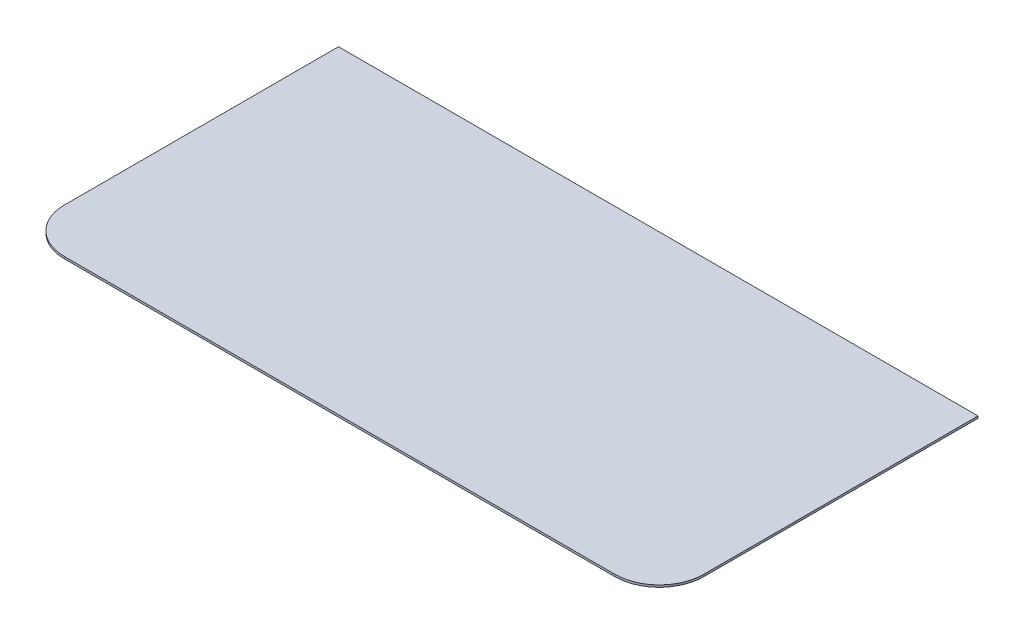
ISO-10303-21;
HEADER;
FILE_DESCRIPTION(('STEP AP214'),'2;1');
FILE_NAME('part.step','',(''),(''),'','','');
FILE_SCHEMA(('AUTOMOTIVE_DESIGN { 1 0 10303 214 1 1 1 1 }'));
ENDSEC;
DATA;
#1=APPLICATION_CONTEXT('core data for automotive mechanical design processes');
#2=APPLICATION_PROTOCOL_DEFINITION('international standard','automotive_design',2000,#1);
#3=PRODUCT_CONTEXT('',#1,'mechanical');
#4=PRODUCT('Part','Part','',(#3));
#5=PRODUCT_RELATED_PRODUCT_CATEGORY('part','',(#4));
#6=PRODUCT_DEFINITION_FORMATION('','',#4);
#7=PRODUCT_DEFINITION_CONTEXT('part definition',#1,'design');
#8=PRODUCT_DEFINITION('design','',#6,#7);
#9=PRODUCT_DEFINITION_SHAPE('','',#8);
#10=(LENGTH_UNIT() NAMED_UNIT(*) SI_UNIT(.MILLI.,.METRE.));
#11=(NAMED_UNIT(*) PLANE_ANGLE_UNIT() SI_UNIT($,.RADIAN.));
#12=(NAMED_UNIT(*) SI_UNIT($,.STERADIAN.) SOLID_ANGLE_UNIT());
#13=UNCERTAINTY_MEASURE_WITH_UNIT(LENGTH_MEASURE(1.E-05),#10,'distance_accuracy_value','');
#14=(GEOMETRIC_REPRESENTATION_CONTEXT(3) GLOBAL_UNCERTAINTY_ASSIGNED_CONTEXT((#13)) GLOBAL_UNIT_ASSIGNED_CONTEXT((#10,
#11,#12)) REPRESENTATION_CONTEXT('',''));
#15=CARTESIAN_POINT('',(0.,0.,0.));
#16=DIRECTION('',(0.,0.,1.));
#17=DIRECTION('',(1.,0.,0.));
#18=AXIS2_PLACEMENT_3D('',#15,#16,#17);
#19=CARTESIAN_POINT('',(0.,1.,0.));
#20=DIRECTION('',(0.,0.,-1.));
#21=DIRECTION('',(-1.,0.,0.));
#22=AXIS2_PLACEMENT_3D('',#19,#20,#21);
#23=PLANE('',#22);
#24=DIRECTION('',(1.,0.,0.));
#25=VECTOR('',#24,1.);
#26=CARTESIAN_POINT('',(0.,1.,0.));
#27=LINE('',#26,#25);
#28=CARTESIAN_POINT('',(-130.,1.,0.));
#29=VERTEX_POINT('',#28);
#30=CARTESIAN_POINT('',(130.,1.,0.));
#31=VERTEX_POINT('',#30);
#32=EDGE_CURVE('E109',#29,#31,#27,.T.);
#33=ORIENTED_EDGE('',*,*,#32,.F.);
#34=DIRECTION('',(0.,-1.,0.));
#35=VECTOR('',#34,1.);
#36=CARTESIAN_POINT('',(-130.,0.,0.));
#37=LINE('',#36,#35);
#38=CARTESIAN_POINT('',(-130.,0.,0.));
#39=VERTEX_POINT('',#38);
#40=EDGE_CURVE('E126',#29,#39,#37,.T.);
#41=ORIENTED_EDGE('',*,*,#40,.T.);
#42=DIRECTION('',(1.,0.,0.));
#43=VECTOR('',#42,1.);
#44=CARTESIAN_POINT('',(0.,0.,0.));
#45=LINE('',#44,#43);
#46=CARTESIAN_POINT('',(130.,0.,0.));
#47=VERTEX_POINT('',#46);
#48=EDGE_CURVE('E103',#39,#47,#45,.T.);
#49=ORIENTED_EDGE('',*,*,#48,.T.);
#50=DIRECTION('',(0.,-1.,0.));
#51=VECTOR('',#50,1.);
#52=CARTESIAN_POINT('',(130.,1.,0.));
#53=LINE('',#52,#51);
#54=EDGE_CURVE('E121',#47,#31,#53,.F.);
#55=ORIENTED_EDGE('',*,*,#54,.T.);
#56=EDGE_LOOP('',(#33,#41,#49,#55));
#57=FACE_BOUND('',#56,.T.);
#58=ADVANCED_FACE('F31',(#57),#23,.F.);
#59=CARTESIAN_POINT('',(151.,1.,-150.5));
#60=DIRECTION('',(-1.,0.,0.));
#61=DIRECTION('',(0.,0.,1.));
#62=AXIS2_PLACEMENT_3D('',#59,#60,#61);
#63=PLANE('',#62);
#64=DIRECTION('',(0.,0.,-1.));
#65=VECTOR('',#64,1.);
#66=CARTESIAN_POINT('',(151.,1.,-150.5));
#67=LINE('',#66,#65);
#68=CARTESIAN_POINT('',(151.,1.,-21.));
#69=VERTEX_POINT('',#68);
#70=CARTESIAN_POINT('',(151.,1.,-150.5));
#71=VERTEX_POINT('',#70);
#72=EDGE_CURVE('E93',#69,#71,#67,.T.);
#73=ORIENTED_EDGE('',*,*,#72,.F.);
#74=DIRECTION('',(0.,-1.,0.));
#75=VECTOR('',#74,1.);
#76=CARTESIAN_POINT('',(151.,1.,-21.));
#77=LINE('',#76,#75);
#78=CARTESIAN_POINT('',(151.,0.,-21.));
#79=VERTEX_POINT('',#78);
#80=EDGE_CURVE('E115',#69,#79,#77,.T.);
#81=ORIENTED_EDGE('',*,*,#80,.T.);
#82=DIRECTION('',(0.,0.,-1.));
#83=VECTOR('',#82,1.);
#84=CARTESIAN_POINT('',(151.,0.,-150.5));
#85=LINE('',#84,#83);
#86=CARTESIAN_POINT('',(151.,0.,-150.5));
#87=VERTEX_POINT('',#86);
#88=EDGE_CURVE('E105',#79,#87,#85,.T.);
#89=ORIENTED_EDGE('',*,*,#88,.T.);
#90=DIRECTION('',(0.,-1.,0.));
#91=VECTOR('',#90,1.);
#92=CARTESIAN_POINT('',(151.,1.,-150.5));
#93=LINE('',#92,#91);
#94=EDGE_CURVE('E97',#71,#87,#93,.T.);
#95=ORIENTED_EDGE('',*,*,#94,.F.);
#96=EDGE_LOOP('',(#73,#81,#89,#95));
#97=FACE_BOUND('',#96,.T.);
#98=ADVANCED_FACE('F141',(#97),#63,.F.);
#99=CARTESIAN_POINT('',(151.,1.,-150.5));
#100=DIRECTION('',(0.,0.,1.));
#101=DIRECTION('',(1.,0.,0.));
#102=AXIS2_PLACEMENT_3D('',#99,#100,#101);
#103=PLANE('',#102);
#104=DIRECTION('',(-1.,0.,0.));
#105=VECTOR('',#104,1.);
#106=CARTESIAN_POINT('',(151.,0.,-150.5));
#107=LINE('',#106,#105);
#108=CARTESIAN_POINT('',(-151.,0.,-150.5));
#109=VERTEX_POINT('',#108);
#110=EDGE_CURVE('E102',#87,#109,#107,.T.);
#111=ORIENTED_EDGE('',*,*,#110,.T.);
#112=DIRECTION('',(0.,-1.,0.));
#113=VECTOR('',#112,1.);
#114=CARTESIAN_POINT('',(-151.,1.,-150.5));
#115=LINE('',#114,#113);
#116=CARTESIAN_POINT('',(-151.,1.,-150.5));
#117=VERTEX_POINT('',#116);
#118=EDGE_CURVE('E84',#117,#109,#115,.T.);
#119=ORIENTED_EDGE('',*,*,#118,.F.);
#120=DIRECTION('',(-1.,0.,0.));
#121=VECTOR('',#120,1.);
#122=CARTESIAN_POINT('',(151.,1.,-150.5));
#123=LINE('',#122,#121);
#124=EDGE_CURVE('E90',#71,#117,#123,.T.);
#125=ORIENTED_EDGE('',*,*,#124,.F.);
#126=ORIENTED_EDGE('',*,*,#94,.T.);
#127=EDGE_LOOP('',(#111,#119,#125,#126));
#128=FACE_BOUND('',#127,.T.);
#129=ADVANCED_FACE('F100',(#128),#103,.F.);
#130=CARTESIAN_POINT('',(151.,1.,0.));
#131=DIRECTION('',(0.,-1.,0.));
#132=DIRECTION('',(0.,0.,-1.));
#133=AXIS2_PLACEMENT_3D('',#130,#131,#132);
#134=PLANE('',#133);
#135=DIRECTION('',(0.,0.,-1.));
#136=VECTOR('',#135,1.);
#137=CARTESIAN_POINT('',(-151.,1.,-150.5));
#138=LINE('',#137,#136);
#139=CARTESIAN_POINT('',(-151.,1.,-21.));
#140=VERTEX_POINT('',#139);
#141=EDGE_CURVE('E80',#140,#117,#138,.T.);
#142=ORIENTED_EDGE('',*,*,#141,.F.);
#143=CARTESIAN_POINT('',(-130.,1.,-21.));
#144=DIRECTION('',(0.,-1.,0.));
#145=DIRECTION('',(0.,0.,-1.));
#146=AXIS2_PLACEMENT_3D('',#143,#144,#145);
#147=CIRCLE('',#146,21.);
#148=EDGE_CURVE('E11',#140,#29,#147,.F.);
#149=ORIENTED_EDGE('',*,*,#148,.T.);
#150=ORIENTED_EDGE('',*,*,#32,.T.);
#151=CARTESIAN_POINT('',(130.,1.,-21.));
#152=DIRECTION('',(0.,-1.,0.));
#153=DIRECTION('',(0.,0.,-1.));
#154=AXIS2_PLACEMENT_3D('',#151,#152,#153);
#155=CIRCLE('',#154,21.);
#156=EDGE_CURVE('E124',#31,#69,#155,.F.);
#157=ORIENTED_EDGE('',*,*,#156,.T.);
#158=ORIENTED_EDGE('',*,*,#72,.T.);
#159=ORIENTED_EDGE('',*,*,#124,.T.);
#160=EDGE_LOOP('',(#142,#149,#150,#157,#158,#159));
#161=FACE_BOUND('',#160,.T.);
#162=ADVANCED_FACE('F91',(#161),#134,.F.);
#163=CARTESIAN_POINT('',(151.,0.,0.));
#164=DIRECTION('',(0.,-1.,0.));
#165=DIRECTION('',(0.,0.,-1.));
#166=AXIS2_PLACEMENT_3D('',#163,#164,#165);
#167=PLANE('',#166);
#168=ORIENTED_EDGE('',*,*,#48,.F.);
#169=CARTESIAN_POINT('',(-130.,0.,-21.));
#170=DIRECTION('',(0.,-1.,0.));
#171=DIRECTION('',(0.,0.,-1.));
#172=AXIS2_PLACEMENT_3D('',#169,#170,#171);
#173=CIRCLE('',#172,21.);
#174=CARTESIAN_POINT('',(-151.,0.,-21.));
#175=VERTEX_POINT('',#174);
#176=EDGE_CURVE('E53',#39,#175,#173,.T.);
#177=ORIENTED_EDGE('',*,*,#176,.T.);
#178=DIRECTION('',(0.,0.,-1.));
#179=VECTOR('',#178,1.);
#180=CARTESIAN_POINT('',(-151.,0.,-150.5));
#181=LINE('',#180,#179);
#182=EDGE_CURVE('E87',#175,#109,#181,.T.);
#183=ORIENTED_EDGE('',*,*,#182,.T.);
#184=ORIENTED_EDGE('',*,*,#110,.F.);
#185=ORIENTED_EDGE('',*,*,#88,.F.);
#186=CARTESIAN_POINT('',(130.,0.,-21.));
#187=DIRECTION('',(0.,-1.,0.));
#188=DIRECTION('',(0.,0.,-1.));
#189=AXIS2_PLACEMENT_3D('',#186,#187,#188);
#190=CIRCLE('',#189,21.);
#191=EDGE_CURVE('E118',#79,#47,#190,.T.);
#192=ORIENTED_EDGE('',*,*,#191,.T.);
#193=EDGE_LOOP('',(#168,#177,#183,#184,#185,#192));
#194=FACE_BOUND('',#193,.T.);
#195=ADVANCED_FACE('F133',(#194),#167,.T.);
#196=CARTESIAN_POINT('',(130.,1.,-21.));
#197=DIRECTION('',(0.,-1.,0.));
#198=DIRECTION('',(0.,0.,-1.));
#199=AXIS2_PLACEMENT_3D('',#196,#197,#198);
#200=CYLINDRICAL_SURFACE('',#199,21.);
#201=ORIENTED_EDGE('',*,*,#156,.F.);
#202=ORIENTED_EDGE('',*,*,#54,.F.);
#203=ORIENTED_EDGE('',*,*,#191,.F.);
#204=ORIENTED_EDGE('',*,*,#80,.F.);
#205=EDGE_LOOP('',(#201,#202,#203,#204));
#206=FACE_BOUND('',#205,.T.);
#207=ADVANCED_FACE('F139',(#206),#200,.T.);
#208=CARTESIAN_POINT('',(-151.,1.,-150.5));
#209=DIRECTION('',(-1.,0.,0.));
#210=DIRECTION('',(0.,0.,1.));
#211=AXIS2_PLACEMENT_3D('',#208,#209,#210);
#212=PLANE('',#211);
#213=ORIENTED_EDGE('',*,*,#182,.F.);
#214=DIRECTION('',(0.,-1.,0.));
#215=VECTOR('',#214,1.);
#216=CARTESIAN_POINT('',(-151.,1.,-21.));
#217=LINE('',#216,#215);
#218=EDGE_CURVE('E39',#175,#140,#217,.F.);
#219=ORIENTED_EDGE('',*,*,#218,.T.);
#220=ORIENTED_EDGE('',*,*,#141,.T.);
#221=ORIENTED_EDGE('',*,*,#118,.T.);
#222=EDGE_LOOP('',(#213,#219,#220,#221));
#223=FACE_BOUND('',#222,.T.);
#224=ADVANCED_FACE('F82',(#223),#212,.T.);
#225=CARTESIAN_POINT('',(-130.,1.,-21.));
#226=DIRECTION('',(0.,1.,0.));
#227=DIRECTION('',(0.,0.,1.));
#228=AXIS2_PLACEMENT_3D('',#225,#226,#227);
#229=CYLINDRICAL_SURFACE('',#228,21.);
#230=ORIENTED_EDGE('',*,*,#148,.F.);
#231=ORIENTED_EDGE('',*,*,#218,.F.);
#232=ORIENTED_EDGE('',*,*,#176,.F.);
#233=ORIENTED_EDGE('',*,*,#40,.F.);
#234=EDGE_LOOP('',(#230,#231,#232,#233));
#235=FACE_BOUND('',#234,.T.);
#236=ADVANCED_FACE('F33',(#235),#229,.T.);
#237=CLOSED_SHELL('',(#58,#98,#129,#162,#195,#207,#224,#236));
#238=MANIFOLD_SOLID_BREP('B2',#237);
#239=ADVANCED_BREP_SHAPE_REPRESENTATION('',(#18,#238),#14);
#240=SHAPE_DEFINITION_REPRESENTATION(#9,#239);
ENDSEC;
END-ISO-10303-21;
